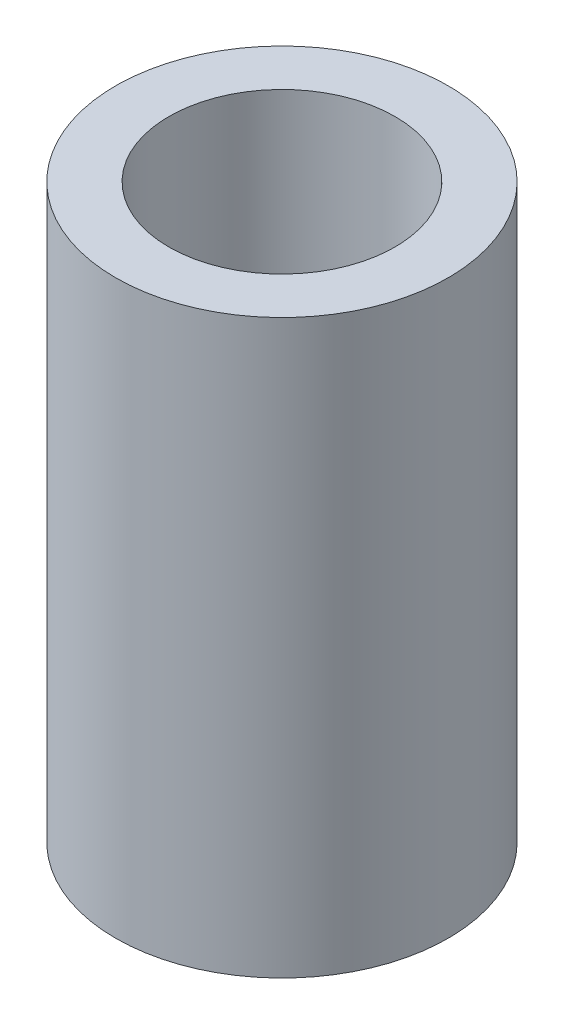
ISO-10303-21;
HEADER;
FILE_DESCRIPTION(('STEP AP214'),'2;1');
FILE_NAME('part.step','',(''),(''),'','','');
FILE_SCHEMA(('AUTOMOTIVE_DESIGN { 1 0 10303 214 1 1 1 1 }'));
ENDSEC;
DATA;
#1=APPLICATION_CONTEXT('core data for automotive mechanical design processes');
#2=APPLICATION_PROTOCOL_DEFINITION('international standard','automotive_design',2000,#1);
#3=PRODUCT_CONTEXT('',#1,'mechanical');
#4=PRODUCT('Part','Part','',(#3));
#5=PRODUCT_RELATED_PRODUCT_CATEGORY('part','',(#4));
#6=PRODUCT_DEFINITION_FORMATION('','',#4);
#7=PRODUCT_DEFINITION_CONTEXT('part definition',#1,'design');
#8=PRODUCT_DEFINITION('design','',#6,#7);
#9=PRODUCT_DEFINITION_SHAPE('','',#8);
#10=(LENGTH_UNIT() NAMED_UNIT(*) SI_UNIT(.MILLI.,.METRE.));
#11=(NAMED_UNIT(*) PLANE_ANGLE_UNIT() SI_UNIT($,.RADIAN.));
#12=(NAMED_UNIT(*) SI_UNIT($,.STERADIAN.) SOLID_ANGLE_UNIT());
#13=UNCERTAINTY_MEASURE_WITH_UNIT(LENGTH_MEASURE(1.E-05),#10,'distance_accuracy_value','');
#14=(GEOMETRIC_REPRESENTATION_CONTEXT(3) GLOBAL_UNCERTAINTY_ASSIGNED_CONTEXT((#13)) GLOBAL_UNIT_ASSIGNED_CONTEXT((#10,
#11,#12)) REPRESENTATION_CONTEXT('',''));
#15=CARTESIAN_POINT('',(0.,0.,0.));
#16=DIRECTION('',(0.,0.,1.));
#17=DIRECTION('',(1.,0.,0.));
#18=AXIS2_PLACEMENT_3D('',#15,#16,#17);
#19=CARTESIAN_POINT('',(0.,21.5,0.));
#20=DIRECTION('',(0.,1.,0.));
#21=DIRECTION('',(0.,0.,1.));
#22=AXIS2_PLACEMENT_3D('',#19,#20,#21);
#23=PLANE('',#22);
#24=CARTESIAN_POINT('',(0.,21.5,0.));
#25=DIRECTION('',(0.,1.,0.));
#26=DIRECTION('',(0.,0.,1.));
#27=AXIS2_PLACEMENT_3D('',#24,#25,#26);
#28=CIRCLE('',#27,6.25);
#29=CARTESIAN_POINT('',(0.,21.5,6.25));
#30=VERTEX_POINT('',#29);
#31=EDGE_CURVE('E10',#30,#30,#28,.T.);
#32=ORIENTED_EDGE('',*,*,#31,.T.);
#33=EDGE_LOOP('',(#32));
#34=FACE_BOUND('',#33,.T.);
#35=CARTESIAN_POINT('',(0.,21.5,0.));
#36=DIRECTION('',(0.,1.,0.));
#37=DIRECTION('',(0.,0.,1.));
#38=AXIS2_PLACEMENT_3D('',#35,#36,#37);
#39=CIRCLE('',#38,4.25);
#40=CARTESIAN_POINT('',(0.,21.5,4.25));
#41=VERTEX_POINT('',#40);
#42=EDGE_CURVE('E41',#41,#41,#39,.T.);
#43=ORIENTED_EDGE('',*,*,#42,.F.);
#44=EDGE_LOOP('',(#43));
#45=FACE_BOUND('',#44,.T.);
#46=ADVANCED_FACE('F30',(#34,#45),#23,.T.);
#47=CARTESIAN_POINT('',(0.,0.,0.));
#48=DIRECTION('',(0.,1.,0.));
#49=DIRECTION('',(0.,0.,1.));
#50=AXIS2_PLACEMENT_3D('',#47,#48,#49);
#51=PLANE('',#50);
#52=CARTESIAN_POINT('',(0.,0.,0.));
#53=DIRECTION('',(0.,1.,0.));
#54=DIRECTION('',(0.,0.,1.));
#55=AXIS2_PLACEMENT_3D('',#52,#53,#54);
#56=CIRCLE('',#55,6.25);
#57=CARTESIAN_POINT('',(0.,0.,6.25));
#58=VERTEX_POINT('',#57);
#59=EDGE_CURVE('E34',#58,#58,#56,.T.);
#60=ORIENTED_EDGE('',*,*,#59,.F.);
#61=EDGE_LOOP('',(#60));
#62=FACE_BOUND('',#61,.T.);
#63=CARTESIAN_POINT('',(0.,0.,0.));
#64=DIRECTION('',(0.,1.,0.));
#65=DIRECTION('',(0.,0.,1.));
#66=AXIS2_PLACEMENT_3D('',#63,#64,#65);
#67=CIRCLE('',#66,4.25);
#68=CARTESIAN_POINT('',(0.,0.,4.25));
#69=VERTEX_POINT('',#68);
#70=EDGE_CURVE('E43',#69,#69,#67,.T.);
#71=ORIENTED_EDGE('',*,*,#70,.T.);
#72=EDGE_LOOP('',(#71));
#73=FACE_BOUND('',#72,.T.);
#74=ADVANCED_FACE('F53',(#62,#73),#51,.F.);
#75=CARTESIAN_POINT('',(0.,21.5,0.));
#76=DIRECTION('',(0.,-1.,0.));
#77=DIRECTION('',(0.,0.,-1.));
#78=AXIS2_PLACEMENT_3D('',#75,#76,#77);
#79=CYLINDRICAL_SURFACE('',#78,6.25);
#80=ORIENTED_EDGE('',*,*,#31,.F.);
#81=EDGE_LOOP('',(#80));
#82=FACE_BOUND('',#81,.T.);
#83=ORIENTED_EDGE('',*,*,#59,.T.);
#84=EDGE_LOOP('',(#83));
#85=FACE_BOUND('',#84,.T.);
#86=ADVANCED_FACE('F32',(#82,#85),#79,.T.);
#87=CARTESIAN_POINT('',(0.,21.5,0.));
#88=DIRECTION('',(0.,-1.,0.));
#89=DIRECTION('',(0.,0.,-1.));
#90=AXIS2_PLACEMENT_3D('',#87,#88,#89);
#91=CYLINDRICAL_SURFACE('',#90,4.25);
#92=ORIENTED_EDGE('',*,*,#42,.T.);
#93=EDGE_LOOP('',(#92));
#94=FACE_BOUND('',#93,.T.);
#95=ORIENTED_EDGE('',*,*,#70,.F.);
#96=EDGE_LOOP('',(#95));
#97=FACE_BOUND('',#96,.T.);
#98=ADVANCED_FACE('F49',(#94,#97),#91,.F.);
#99=CLOSED_SHELL('',(#46,#74,#86,#98));
#100=MANIFOLD_SOLID_BREP('B2',#99);
#101=ADVANCED_BREP_SHAPE_REPRESENTATION('',(#18,#100),#14);
#102=SHAPE_DEFINITION_REPRESENTATION(#9,#101);
ENDSEC;
END-ISO-10303-21;
